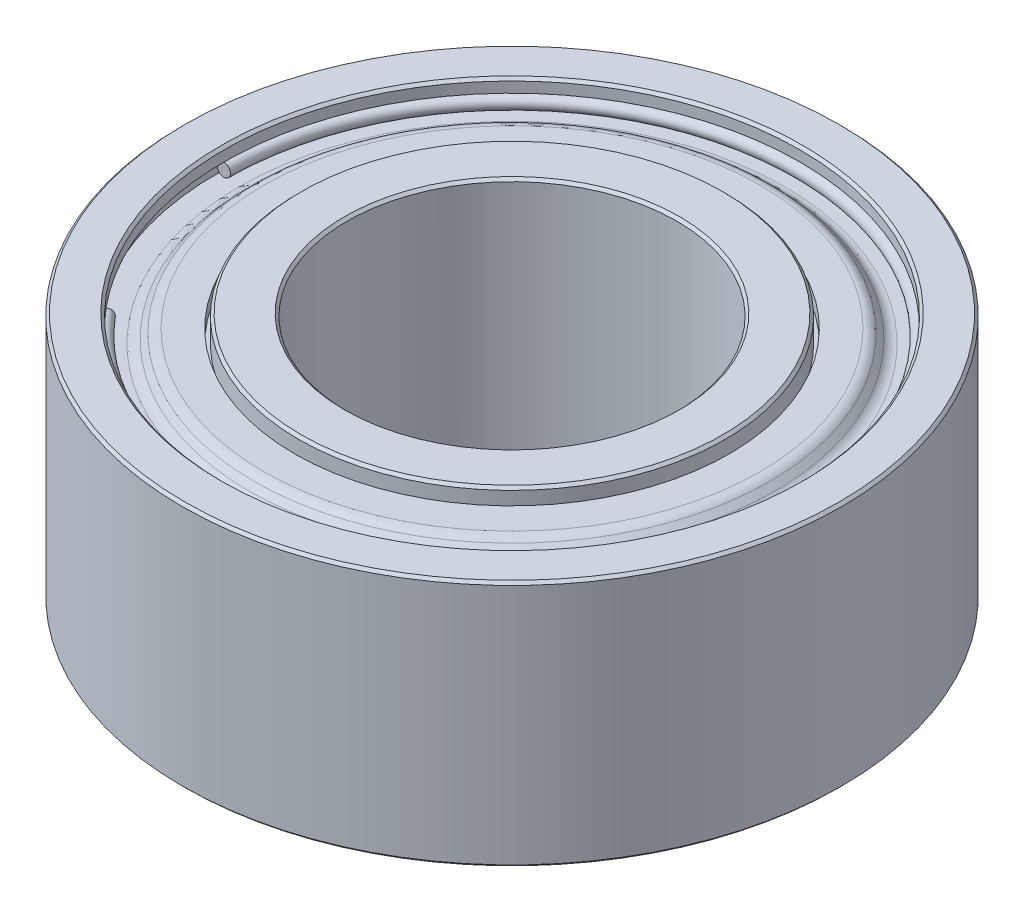
ISO-10303-21;
HEADER;
FILE_DESCRIPTION(('STEP AP214'),'2;1');
FILE_NAME('part.step','',(''),(''),'','','');
FILE_SCHEMA(('AUTOMOTIVE_DESIGN { 1 0 10303 214 1 1 1 1 }'));
ENDSEC;
DATA;
#1=APPLICATION_CONTEXT('core data for automotive mechanical design processes');
#2=APPLICATION_PROTOCOL_DEFINITION('international standard','automotive_design',2000,#1);
#3=PRODUCT_CONTEXT('',#1,'mechanical');
#4=PRODUCT('Part','Part','',(#3));
#5=PRODUCT_RELATED_PRODUCT_CATEGORY('part','',(#4));
#6=PRODUCT_DEFINITION_FORMATION('','',#4);
#7=PRODUCT_DEFINITION_CONTEXT('part definition',#1,'design');
#8=PRODUCT_DEFINITION('design','',#6,#7);
#9=PRODUCT_DEFINITION_SHAPE('','',#8);
#10=(LENGTH_UNIT() NAMED_UNIT(*) SI_UNIT(.MILLI.,.METRE.));
#11=(NAMED_UNIT(*) PLANE_ANGLE_UNIT() SI_UNIT($,.RADIAN.));
#12=(NAMED_UNIT(*) SI_UNIT($,.STERADIAN.) SOLID_ANGLE_UNIT());
#13=UNCERTAINTY_MEASURE_WITH_UNIT(LENGTH_MEASURE(1.E-05),#10,'distance_accuracy_value','');
#14=(GEOMETRIC_REPRESENTATION_CONTEXT(3) GLOBAL_UNCERTAINTY_ASSIGNED_CONTEXT((#13)) GLOBAL_UNIT_ASSIGNED_CONTEXT((#10,
#11,#12)) REPRESENTATION_CONTEXT('',''));
#15=CARTESIAN_POINT('',(0.,0.,0.));
#16=DIRECTION('',(0.,0.,1.));
#17=DIRECTION('',(1.,0.,0.));
#18=AXIS2_PLACEMENT_3D('',#15,#16,#17);
#19=CARTESIAN_POINT('',(0.,0.,0.));
#20=DIRECTION('',(0.64278760968653,0.,0.766044443118986));
#21=DIRECTION('',(0.766044443118986,0.,-0.64278760968653));
#22=AXIS2_PLACEMENT_3D('',#19,#20,#21);
#23=PLANE('',#22);
#24=CARTESIAN_POINT('',(-4.15418241058994,2.00025,3.48577292856909));
#25=CARTESIAN_POINT('',(-4.15418930493398,2.01448035707391,3.48577871361062));
#26=CARTESIAN_POINT('',(-4.15604733989819,2.02879828029162,3.48733779006381));
#27=CARTESIAN_POINT('',(-4.16328592517261,2.05577713981076,3.49341168429782));
#28=CARTESIAN_POINT('',(-4.16866647548281,2.06843807611218,3.49792650207864));
#29=CARTESIAN_POINT('',(-4.18233551241622,2.0907338982527,3.50939618592801));
#30=CARTESIAN_POINT('',(-4.1906239990395,2.10036878409172,3.51635105199662));
#31=CARTESIAN_POINT('',(-4.20917658235864,2.11551068307499,3.5319185178171));
#32=CARTESIAN_POINT('',(-4.2194406790545,2.12101769621925,3.54053111756897));
#33=CARTESIAN_POINT('',(-4.24078669527091,2.12728686264336,3.55844255190326));
#34=CARTESIAN_POINT('',(-4.25186861479146,2.12804901592321,3.56774138648568));
#35=CARTESIAN_POINT('',(-4.2736010893698,2.12474255040931,3.58597709788894));
#36=CARTESIAN_POINT('',(-4.2842516444276,2.12067393161555,3.59491397470978));
#37=CARTESIAN_POINT('',(-4.3039203487017,2.10816068190603,3.6114179772119));
#38=CARTESIAN_POINT('',(-4.31293849791799,2.09971605099026,3.61898510289319));
#39=CARTESIAN_POINT('',(-4.32832653587489,2.07941861413728,3.63189719986737));
#40=CARTESIAN_POINT('',(-4.33469642461549,2.06756580820007,3.63724217116025));
#41=CARTESIAN_POINT('',(-4.34406656395272,2.0417292051199,3.64510465162219));
#42=CARTESIAN_POINT('',(-4.34706681454934,2.02774540797693,3.64762216079126));
#43=CARTESIAN_POINT('',(-4.34858022980807,2.00916030553464,3.64889206697668));
#44=CARTESIAN_POINT('',(-4.34875985966417,2.00470945246293,3.64904279432268));
#45=CARTESIAN_POINT('',(-4.34875080479814,1.98601964292609,3.64903519638793));
#46=CARTESIAN_POINT('',(-4.34689276983392,1.97170171970838,3.64747611993475));
#47=CARTESIAN_POINT('',(-4.3396541845595,1.94472286018924,3.64140222570074));
#48=CARTESIAN_POINT('',(-4.3342736342493,1.93206192388782,3.63688740791991));
#49=CARTESIAN_POINT('',(-4.32060459731589,1.9097661017473,3.62541772407054));
#50=CARTESIAN_POINT('',(-4.31231611069261,1.90013121590828,3.61846285800193));
#51=CARTESIAN_POINT('',(-4.29376352737347,1.884989316925,3.60289539218146));
#52=CARTESIAN_POINT('',(-4.28349943067761,1.87948230378075,3.59428279242959));
#53=CARTESIAN_POINT('',(-4.2621534144612,1.87321313735664,3.5763713580953));
#54=CARTESIAN_POINT('',(-4.25107149494066,1.87245098407679,3.56707252351287));
#55=CARTESIAN_POINT('',(-4.22933902036231,1.87575744959069,3.54883681210961));
#56=CARTESIAN_POINT('',(-4.21868846530451,1.87982606838444,3.53989993528878));
#57=CARTESIAN_POINT('',(-4.19901976103042,1.89233931809397,3.52339593278665));
#58=CARTESIAN_POINT('',(-4.19000161181412,1.90078394900974,3.51582880710536));
#59=CARTESIAN_POINT('',(-4.17461357385723,1.92108138586272,3.50291671013119));
#60=CARTESIAN_POINT('',(-4.16824368511663,1.93293419179993,3.49757173883831));
#61=CARTESIAN_POINT('',(-4.1588735457794,1.9587707948801,3.48970925837636));
#62=CARTESIAN_POINT('',(-4.15587329518277,1.97275459202306,3.48719174920729));
#63=CARTESIAN_POINT('',(-4.15435987992404,1.99133969446536,3.48592184302187));
#64=CARTESIAN_POINT('',(-4.15418025006795,1.99579054753707,3.48577111567587));
#65=CARTESIAN_POINT('',(-4.15418241058994,2.00025,3.48577292856909));
#66=B_SPLINE_CURVE_WITH_KNOTS('',3,(#24,#25,#26,#27,#28,#29,#30,#31,#32,#33,#34,#35,#36,#37,#38,
#39,#40,#41,#42,#43,#44,#45,#46,#47,#48,#49,#50,#51,#52,#53,#54,#55,#56,#57,#58,#59,#60,#61,#62,
#63,#64,#65),.UNSPECIFIED.,.T.,.F.,(4,2,2,2,2,2,2,2,2,2,2,2,2,2,2,2,2,2,2,2,4),(0.,
0.0426429642402334,0.0852859284804667,0.127928892721777,0.170571856963085,0.213214821204394,
0.255857785445703,0.298500749687013,0.341143713928323,0.383786678169631,0.397149959984691,
0.439792924224925,0.482435888465158,0.525078852706467,0.567721816947776,0.610364781189085,
0.653007745430396,0.695650709671704,0.738293673913014,0.780936638154323,0.794299919969383),.UNSPECIFIED.);
#67=CARTESIAN_POINT('',(-4.15418241058994,2.00025,3.48577292856909));
#68=VERTEX_POINT('',#67);
#69=EDGE_CURVE('P0_E18',#68,#68,#66,.T.);
#70=ORIENTED_EDGE('',*,*,#69,.F.);
#71=EDGE_LOOP('',(#70));
#72=FACE_BOUND('',#71,.T.);
#73=ADVANCED_FACE('P0_F14',(#72),#23,.F.);
#74=CARTESIAN_POINT('',(0.,0.,0.));
#75=DIRECTION('',(0.,0.,1.));
#76=DIRECTION('',(1.,0.,0.));
#77=AXIS2_PLACEMENT_3D('',#74,#75,#76);
#78=PLANE('',#77);
#79=CARTESIAN_POINT('',(-5.6769,2.00025,0.));
#80=CARTESIAN_POINT('',(-5.67689100007304,2.01448035707391,0.));
#81=CARTESIAN_POINT('',(-5.67446550768693,2.02879828029162,0.));
#82=CARTESIAN_POINT('',(-5.66501620570525,2.05577713981076,0.));
#83=CARTESIAN_POINT('',(-5.65799239610969,2.06843807611218,0.));
#84=CARTESIAN_POINT('',(-5.64014873565866,2.0907338982527,0.));
#85=CARTESIAN_POINT('',(-5.62932888480311,2.10036878409172,0.));
#86=CARTESIAN_POINT('',(-5.60511020730236,2.11551068307499,0.));
#87=CARTESIAN_POINT('',(-5.59171138065716,2.12101769621925,0.));
#88=CARTESIAN_POINT('',(-5.56384613549006,2.12728686264336,0.));
#89=CARTESIAN_POINT('',(-5.54937971696815,2.12804901592321,0.));
#90=CARTESIAN_POINT('',(-5.52100998623835,2.12474255040931,0.));
#91=CARTESIAN_POINT('',(-5.50710667403046,2.12067393161555,0.));
#92=CARTESIAN_POINT('',(-5.48143100409933,2.10816068190603,0.));
#93=CARTESIAN_POINT('',(-5.4696586463761,2.09971605099026,0.));
#94=CARTESIAN_POINT('',(-5.44957098945865,2.07941861413728,0.));
#95=CARTESIAN_POINT('',(-5.44125569026443,2.06756580820007,0.));
#96=CARTESIAN_POINT('',(-5.42902384207155,2.0417292051199,0.));
#97=CARTESIAN_POINT('',(-5.4251072930729,2.02774540797694,0.));
#98=CARTESIAN_POINT('',(-5.42313166976236,2.00916030553464,0.));
#99=CARTESIAN_POINT('',(-5.42289717963883,2.00470945246293,0.));
#100=CARTESIAN_POINT('',(-5.42290899992696,1.98601964292609,0.));
#101=CARTESIAN_POINT('',(-5.42533449231307,1.97170171970838,0.));
#102=CARTESIAN_POINT('',(-5.43478379429475,1.94472286018924,0.));
#103=CARTESIAN_POINT('',(-5.44180760389031,1.93206192388782,0.));
#104=CARTESIAN_POINT('',(-5.45965126434134,1.9097661017473,0.));
#105=CARTESIAN_POINT('',(-5.47047111519689,1.90013121590828,0.));
#106=CARTESIAN_POINT('',(-5.49468979269764,1.884989316925,0.));
#107=CARTESIAN_POINT('',(-5.50808861934284,1.87948230378075,0.));
#108=CARTESIAN_POINT('',(-5.53595386450994,1.87321313735664,0.));
#109=CARTESIAN_POINT('',(-5.55042028303185,1.87245098407679,0.));
#110=CARTESIAN_POINT('',(-5.57879001376165,1.87575744959069,0.));
#111=CARTESIAN_POINT('',(-5.59269332596954,1.87982606838444,0.));
#112=CARTESIAN_POINT('',(-5.61836899590066,1.89233931809397,0.));
#113=CARTESIAN_POINT('',(-5.6301413536239,1.90078394900974,0.));
#114=CARTESIAN_POINT('',(-5.65022901054135,1.92108138586272,0.));
#115=CARTESIAN_POINT('',(-5.65854430973557,1.93293419179993,0.));
#116=CARTESIAN_POINT('',(-5.67077615792845,1.9587707948801,0.));
#117=CARTESIAN_POINT('',(-5.6746927069271,1.97275459202306,0.));
#118=CARTESIAN_POINT('',(-5.67666833023764,1.99133969446536,0.));
#119=CARTESIAN_POINT('',(-5.67690282036117,1.99579054753707,0.));
#120=CARTESIAN_POINT('',(-5.6769,2.00025,0.));
#121=B_SPLINE_CURVE_WITH_KNOTS('',3,(#79,#80,#81,#82,#83,#84,#85,#86,#87,#88,#89,#90,#91,#92,
#93,#94,#95,#96,#97,#98,#99,#100,#101,#102,#103,#104,#105,#106,#107,#108,#109,#110,#111,#112,
#113,#114,#115,#116,#117,#118,#119,#120),.UNSPECIFIED.,.T.,.F.,(4,2,2,2,2,2,2,2,2,2,2,2,2,2,2,2,
2,2,2,2,4),(0.,0.0426429642402329,0.0852859284804661,0.127928892721774,0.170571856963085,
0.213214821204393,0.255857785445703,0.298500749687013,0.341143713928322,0.383786678169631,
0.397149959984692,0.439792924224925,0.482435888465158,0.525078852706467,0.567721816947776,
0.610364781189086,0.653007745430395,0.695650709671704,0.738293673913013,0.780936638154323,
0.794299919969383),.UNSPECIFIED.);
#122=CARTESIAN_POINT('',(-5.6769,2.00025,0.));
#123=VERTEX_POINT('',#122);
#124=EDGE_CURVE('P0_E9',#123,#123,#121,.T.);
#125=ORIENTED_EDGE('',*,*,#124,.F.);
#126=EDGE_LOOP('',(#125));
#127=FACE_BOUND('',#126,.T.);
#128=ADVANCED_FACE('P0_F36',(#127),#78,.T.);
#129=CARTESIAN_POINT('',(0.,2.00025,0.));
#130=DIRECTION('',(0.,1.,0.));
#131=DIRECTION('',(0.,0.,1.));
#132=AXIS2_PLACEMENT_3D('',#129,#130,#131);
#133=TOROIDAL_SURFACE('',#132,5.5499,0.127000000000001);
#134=ORIENTED_EDGE('',*,*,#124,.T.);
#135=EDGE_LOOP('',(#134));
#136=FACE_BOUND('',#135,.T.);
#137=ORIENTED_EDGE('',*,*,#69,.T.);
#138=EDGE_LOOP('',(#137));
#139=FACE_BOUND('',#138,.T.);
#140=ADVANCED_FACE('P0_F34',(#136,#139),#133,.T.);
#141=CLOSED_SHELL('',(#73,#128,#140));
#142=MANIFOLD_SOLID_BREP('P0_B1',#141);
#143=CARTESIAN_POINT('',(0.,0.,0.));
#144=DIRECTION('',(0.,0.,1.));
#145=DIRECTION('',(1.,0.,0.));
#146=AXIS2_PLACEMENT_3D('',#143,#144,#145);
#147=PLANE('',#146);
#148=CARTESIAN_POINT('',(-5.4229,-2.00025,0.));
#149=CARTESIAN_POINT('',(-5.42290899992696,-2.01448035707391,0.));
#150=CARTESIAN_POINT('',(-5.42533449231307,-2.02879828029162,0.));
#151=CARTESIAN_POINT('',(-5.43478379429475,-2.05577713981076,0.));
#152=CARTESIAN_POINT('',(-5.44180760389031,-2.06843807611218,0.));
#153=CARTESIAN_POINT('',(-5.45965126434134,-2.0907338982527,0.));
#154=CARTESIAN_POINT('',(-5.47047111519689,-2.10036878409172,0.));
#155=CARTESIAN_POINT('',(-5.49468979269764,-2.11551068307499,0.));
#156=CARTESIAN_POINT('',(-5.50808861934284,-2.12101769621925,0.));
#157=CARTESIAN_POINT('',(-5.53595386450994,-2.12728686264336,0.));
#158=CARTESIAN_POINT('',(-5.55042028303185,-2.12804901592321,0.));
#159=CARTESIAN_POINT('',(-5.57879001376165,-2.12474255040931,0.));
#160=CARTESIAN_POINT('',(-5.59269332596954,-2.12067393161555,0.));
#161=CARTESIAN_POINT('',(-5.61836899590066,-2.10816068190603,0.));
#162=CARTESIAN_POINT('',(-5.6301413536239,-2.09971605099026,0.));
#163=CARTESIAN_POINT('',(-5.65022901054135,-2.07941861413728,0.));
#164=CARTESIAN_POINT('',(-5.65854430973557,-2.06756580820007,0.));
#165=CARTESIAN_POINT('',(-5.67077615792845,-2.0417292051199,0.));
#166=CARTESIAN_POINT('',(-5.6746927069271,-2.02774540797694,0.));
#167=CARTESIAN_POINT('',(-5.67666833023764,-2.00916030553464,0.));
#168=CARTESIAN_POINT('',(-5.67690282036117,-2.00470945246293,0.));
#169=CARTESIAN_POINT('',(-5.67689100007304,-1.98601964292609,0.));
#170=CARTESIAN_POINT('',(-5.67446550768693,-1.97170171970838,0.));
#171=CARTESIAN_POINT('',(-5.66501620570525,-1.94472286018924,0.));
#172=CARTESIAN_POINT('',(-5.65799239610969,-1.93206192388782,0.));
#173=CARTESIAN_POINT('',(-5.64014873565866,-1.9097661017473,0.));
#174=CARTESIAN_POINT('',(-5.62932888480311,-1.90013121590828,0.));
#175=CARTESIAN_POINT('',(-5.60511020730236,-1.884989316925,0.));
#176=CARTESIAN_POINT('',(-5.59171138065716,-1.87948230378075,0.));
#177=CARTESIAN_POINT('',(-5.56384613549006,-1.87321313735664,0.));
#178=CARTESIAN_POINT('',(-5.54937971696815,-1.87245098407679,0.));
#179=CARTESIAN_POINT('',(-5.52100998623835,-1.87575744959069,0.));
#180=CARTESIAN_POINT('',(-5.50710667403046,-1.87982606838444,0.));
#181=CARTESIAN_POINT('',(-5.48143100409934,-1.89233931809397,0.));
#182=CARTESIAN_POINT('',(-5.4696586463761,-1.90078394900974,0.));
#183=CARTESIAN_POINT('',(-5.44957098945865,-1.92108138586272,0.));
#184=CARTESIAN_POINT('',(-5.44125569026443,-1.93293419179993,0.));
#185=CARTESIAN_POINT('',(-5.42902384207155,-1.9587707948801,0.));
#186=CARTESIAN_POINT('',(-5.4251072930729,-1.97275459202306,0.));
#187=CARTESIAN_POINT('',(-5.42313166976236,-1.99133969446536,0.));
#188=CARTESIAN_POINT('',(-5.42289717963883,-1.99579054753707,0.));
#189=CARTESIAN_POINT('',(-5.4229,-2.00025,0.));
#190=B_SPLINE_CURVE_WITH_KNOTS('',3,(#148,#149,#150,#151,#152,#153,#154,#155,#156,#157,#158,
#159,#160,#161,#162,#163,#164,#165,#166,#167,#168,#169,#170,#171,#172,#173,#174,#175,#176,#177,
#178,#179,#180,#181,#182,#183,#184,#185,#186,#187,#188,#189),.UNSPECIFIED.,.T.,.F.,(4,2,2,2,2,2,
2,2,2,2,2,2,2,2,2,2,2,2,2,2,4),(0.,0.0426429642402333,0.0852859284804666,0.127928892721776,
0.170571856963085,0.213214821204395,0.255857785445704,0.298500749687012,0.341143713928322,
0.383786678169631,0.397149959984692,0.439792924224925,0.482435888465158,0.525078852706467,
0.567721816947776,0.610364781189086,0.653007745430394,0.695650709671705,0.738293673913014,
0.780936638154323,0.794299919969383),.UNSPECIFIED.);
#191=CARTESIAN_POINT('',(-5.4229,-2.00025,0.));
#192=VERTEX_POINT('',#191);
#193=EDGE_CURVE('P1_E19',#192,#192,#190,.T.);
#194=ORIENTED_EDGE('',*,*,#193,.F.);
#195=EDGE_LOOP('',(#194));
#196=FACE_BOUND('',#195,.T.);
#197=ADVANCED_FACE('P1_F15',(#196),#147,.T.);
#198=CARTESIAN_POINT('',(0.,0.,0.));
#199=DIRECTION('',(0.64278760968653,0.,0.766044443118986));
#200=DIRECTION('',(0.766044443118986,0.,-0.64278760968653));
#201=AXIS2_PLACEMENT_3D('',#198,#199,#200);
#202=PLANE('',#201);
#203=CARTESIAN_POINT('',(-4.34875769914217,-2.00025,3.64904098142946));
#204=CARTESIAN_POINT('',(-4.34875080479814,-2.01448035707391,3.64903519638793));
#205=CARTESIAN_POINT('',(-4.34689276983393,-2.02879828029162,3.64747611993474));
#206=CARTESIAN_POINT('',(-4.33965418455951,-2.05577713981076,3.64140222570073));
#207=CARTESIAN_POINT('',(-4.3342736342493,-2.06843807611218,3.63688740791991));
#208=CARTESIAN_POINT('',(-4.32060459731589,-2.0907338982527,3.62541772407054));
#209=CARTESIAN_POINT('',(-4.31231611069262,-2.10036878409172,3.61846285800193));
#210=CARTESIAN_POINT('',(-4.29376352737348,-2.11551068307499,3.60289539218145));
#211=CARTESIAN_POINT('',(-4.28349943067761,-2.12101769621925,3.59428279242959));
#212=CARTESIAN_POINT('',(-4.2621534144612,-2.12728686264336,3.57637135809529));
#213=CARTESIAN_POINT('',(-4.25107149494066,-2.12804901592321,3.56707252351287));
#214=CARTESIAN_POINT('',(-4.22933902036231,-2.12474255040931,3.54883681210961));
#215=CARTESIAN_POINT('',(-4.21868846530451,-2.12067393161555,3.53989993528878));
#216=CARTESIAN_POINT('',(-4.19901976103042,-2.10816068190603,3.52339593278665));
#217=CARTESIAN_POINT('',(-4.19000161181413,-2.09971605099026,3.51582880710536));
#218=CARTESIAN_POINT('',(-4.17461357385723,-2.07941861413728,3.50291671013118));
#219=CARTESIAN_POINT('',(-4.16824368511663,-2.06756580820007,3.4975717388383));
#220=CARTESIAN_POINT('',(-4.1588735457794,-2.0417292051199,3.48970925837636));
#221=CARTESIAN_POINT('',(-4.15587329518277,-2.02774540797694,3.48719174920729));
#222=CARTESIAN_POINT('',(-4.15435987992404,-2.00916030553464,3.48592184302187));
#223=CARTESIAN_POINT('',(-4.15418025006795,-2.00470945246293,3.48577111567587));
#224=CARTESIAN_POINT('',(-4.15418930493398,-1.98601964292609,3.48577871361062));
#225=CARTESIAN_POINT('',(-4.15604733989819,-1.97170171970838,3.4873377900638));
#226=CARTESIAN_POINT('',(-4.16328592517261,-1.94472286018924,3.49341168429781));
#227=CARTESIAN_POINT('',(-4.16866647548282,-1.93206192388782,3.49792650207864));
#228=CARTESIAN_POINT('',(-4.18233551241623,-1.9097661017473,3.50939618592801));
#229=CARTESIAN_POINT('',(-4.1906239990395,-1.90013121590828,3.51635105199662));
#230=CARTESIAN_POINT('',(-4.20917658235864,-1.884989316925,3.5319185178171));
#231=CARTESIAN_POINT('',(-4.2194406790545,-1.87948230378075,3.54053111756896));
#232=CARTESIAN_POINT('',(-4.24078669527091,-1.87321313735664,3.55844255190326));
#233=CARTESIAN_POINT('',(-4.25186861479146,-1.87245098407679,3.56774138648568));
#234=CARTESIAN_POINT('',(-4.2736010893698,-1.87575744959069,3.58597709788894));
#235=CARTESIAN_POINT('',(-4.28425164442761,-1.87982606838444,3.59491397470977));
#236=CARTESIAN_POINT('',(-4.3039203487017,-1.89233931809397,3.6114179772119));
#237=CARTESIAN_POINT('',(-4.31293849791799,-1.90078394900974,3.61898510289319));
#238=CARTESIAN_POINT('',(-4.32832653587489,-1.92108138586272,3.63189719986736));
#239=CARTESIAN_POINT('',(-4.33469642461549,-1.93293419179993,3.63724217116024));
#240=CARTESIAN_POINT('',(-4.34406656395272,-1.9587707948801,3.64510465162219));
#241=CARTESIAN_POINT('',(-4.34706681454934,-1.97275459202306,3.64762216079126));
#242=CARTESIAN_POINT('',(-4.34858022980807,-1.99133969446536,3.64889206697668));
#243=CARTESIAN_POINT('',(-4.34875985966417,-1.99579054753707,3.64904279432267));
#244=CARTESIAN_POINT('',(-4.34875769914217,-2.00025,3.64904098142946));
#245=B_SPLINE_CURVE_WITH_KNOTS('',3,(#203,#204,#205,#206,#207,#208,#209,#210,#211,#212,#213,
#214,#215,#216,#217,#218,#219,#220,#221,#222,#223,#224,#225,#226,#227,#228,#229,#230,#231,#232,
#233,#234,#235,#236,#237,#238,#239,#240,#241,#242,#243,#244),.UNSPECIFIED.,.T.,.F.,(4,2,2,2,2,2,
2,2,2,2,2,2,2,2,2,2,2,2,2,2,4),(0.,0.0426429642402328,0.0852859284804664,0.127928892721775,
0.170571856963085,0.213214821204396,0.255857785445703,0.298500749687012,0.341143713928322,
0.383786678169631,0.397149959984692,0.439792924224925,0.482435888465158,0.525078852706467,
0.567721816947776,0.610364781189086,0.653007745430396,0.695650709671705,0.738293673913013,
0.780936638154323,0.794299919969383),.UNSPECIFIED.);
#246=CARTESIAN_POINT('',(-4.34875769914217,-2.00025,3.64904098142946));
#247=VERTEX_POINT('',#246);
#248=EDGE_CURVE('P1_E10',#247,#247,#245,.T.);
#249=ORIENTED_EDGE('',*,*,#248,.F.);
#250=EDGE_LOOP('',(#249));
#251=FACE_BOUND('',#250,.T.);
#252=ADVANCED_FACE('P1_F35',(#251),#202,.F.);
#253=CARTESIAN_POINT('',(0.,-2.00025,0.));
#254=DIRECTION('',(0.,-1.,0.));
#255=DIRECTION('',(0.,0.,1.));
#256=AXIS2_PLACEMENT_3D('',#253,#254,#255);
#257=TOROIDAL_SURFACE('',#256,5.5499,0.127000000000001);
#258=ORIENTED_EDGE('',*,*,#248,.T.);
#259=EDGE_LOOP('',(#258));
#260=FACE_BOUND('',#259,.T.);
#261=ORIENTED_EDGE('',*,*,#193,.T.);
#262=EDGE_LOOP('',(#261));
#263=FACE_BOUND('',#262,.T.);
#264=ADVANCED_FACE('P1_F37',(#260,#263),#257,.T.);
#265=CLOSED_SHELL('',(#197,#252,#264));
#266=MANIFOLD_SOLID_BREP('P1_B1',#265);
#267=CARTESIAN_POINT('',(0.,2.38125,0.));
#268=DIRECTION('',(0.,-1.,0.));
#269=DIRECTION('',(0.,0.,-1.));
#270=AXIS2_PLACEMENT_3D('',#267,#268,#269);
#271=CYLINDRICAL_SURFACE('',#270,3.175);
#272=CARTESIAN_POINT('',(0.,-2.33045000004495,0.));
#273=DIRECTION('',(0.,-1.,0.));
#274=DIRECTION('',(0.,0.,-1.));
#275=AXIS2_PLACEMENT_3D('',#272,#273,#274);
#276=CIRCLE('',#275,3.17499999999882);
#277=CARTESIAN_POINT('',(0.,-2.33045000004495,-3.17499999999882));
#278=VERTEX_POINT('',#277);
#279=EDGE_CURVE('P2_E410',#278,#278,#276,.T.);
#280=ORIENTED_EDGE('',*,*,#279,.T.);
#281=EDGE_LOOP('',(#280));
#282=FACE_BOUND('',#281,.T.);
#283=CARTESIAN_POINT('',(0.,2.3304499999881,0.));
#284=DIRECTION('',(0.,1.,0.));
#285=DIRECTION('',(0.,0.,1.));
#286=AXIS2_PLACEMENT_3D('',#283,#284,#285);
#287=CIRCLE('',#286,3.17500000005566);
#288=CARTESIAN_POINT('',(0.,2.3304499999881,3.17500000005566));
#289=VERTEX_POINT('',#288);
#290=EDGE_CURVE('P2_E413',#289,#289,#287,.T.);
#291=ORIENTED_EDGE('',*,*,#290,.T.);
#292=EDGE_LOOP('',(#291));
#293=FACE_BOUND('',#292,.T.);
#294=ADVANCED_FACE('P2_F17',(#282,#293),#271,.F.);
#295=CARTESIAN_POINT('',(0.,2.38124999992806,0.));
#296=DIRECTION('',(0.,1.,0.));
#297=DIRECTION('',(0.,0.,1.));
#298=AXIS2_PLACEMENT_3D('',#295,#296,#297);
#299=CONICAL_SURFACE('',#298,3.22579999999562,0.785398163397448);
#300=ORIENTED_EDGE('',*,*,#290,.F.);
#301=EDGE_LOOP('',(#300));
#302=FACE_BOUND('',#301,.T.);
#303=CARTESIAN_POINT('',(0.,2.38124999992806,0.));
#304=DIRECTION('',(0.,1.,0.));
#305=DIRECTION('',(0.,0.,1.));
#306=AXIS2_PLACEMENT_3D('',#303,#304,#305);
#307=CIRCLE('',#306,3.22579999999562);
#308=CARTESIAN_POINT('',(0.,2.38124999992806,3.22579999999562));
#309=VERTEX_POINT('',#308);
#310=EDGE_CURVE('P2_E408',#309,#309,#307,.F.);
#311=ORIENTED_EDGE('',*,*,#310,.F.);
#312=EDGE_LOOP('',(#311));
#313=FACE_BOUND('',#312,.T.);
#314=ADVANCED_FACE('P2_F186',(#302,#313),#299,.F.);
#315=CARTESIAN_POINT('',(0.,-2.3812499999849,0.));
#316=DIRECTION('',(0.,-1.,0.));
#317=DIRECTION('',(0.,0.,-1.));
#318=AXIS2_PLACEMENT_3D('',#315,#316,#317);
#319=CONICAL_SURFACE('',#318,3.22579999993877,0.785398162837966);
#320=CARTESIAN_POINT('',(0.,-2.3812499999849,0.));
#321=DIRECTION('',(0.,-1.,0.));
#322=DIRECTION('',(0.,0.,-1.));
#323=AXIS2_PLACEMENT_3D('',#320,#321,#322);
#324=CIRCLE('',#323,3.22579999993877);
#325=CARTESIAN_POINT('',(0.,-2.3812499999849,-3.22579999993877));
#326=VERTEX_POINT('',#325);
#327=EDGE_CURVE('P2_E406',#326,#326,#324,.T.);
#328=ORIENTED_EDGE('',*,*,#327,.T.);
#329=EDGE_LOOP('',(#328));
#330=FACE_BOUND('',#329,.T.);
#331=ORIENTED_EDGE('',*,*,#279,.F.);
#332=EDGE_LOOP('',(#331));
#333=FACE_BOUND('',#332,.T.);
#334=ADVANCED_FACE('P2_F183',(#330,#333),#319,.F.);
#335=CARTESIAN_POINT('',(0.,2.38125,0.));
#336=DIRECTION('',(0.,1.,0.));
#337=DIRECTION('',(0.,0.,1.));
#338=AXIS2_PLACEMENT_3D('',#335,#336,#337);
#339=PLANE('',#338);
#340=ORIENTED_EDGE('',*,*,#310,.T.);
#341=EDGE_LOOP('',(#340));
#342=FACE_BOUND('',#341,.T.);
#343=CARTESIAN_POINT('',(0.,2.3812499999849,0.));
#344=DIRECTION('',(0.,-1.,0.));
#345=DIRECTION('',(0.,0.,-1.));
#346=AXIS2_PLACEMENT_3D('',#343,#344,#345);
#347=CIRCLE('',#346,4.05764999999292);
#348=CARTESIAN_POINT('',(0.,2.3812499999849,-4.05764999999292));
#349=VERTEX_POINT('',#348);
#350=EDGE_CURVE('P2_E403',#349,#349,#347,.T.);
#351=ORIENTED_EDGE('',*,*,#350,.F.);
#352=EDGE_LOOP('',(#351));
#353=FACE_BOUND('',#352,.T.);
#354=ADVANCED_FACE('P2_F179',(#342,#353),#339,.T.);
#355=CARTESIAN_POINT('',(0.,-2.38125,0.));
#356=DIRECTION('',(0.,1.,0.));
#357=DIRECTION('',(0.,0.,1.));
#358=AXIS2_PLACEMENT_3D('',#355,#356,#357);
#359=PLANE('',#358);
#360=CARTESIAN_POINT('',(0.,-2.38125000004175,0.));
#361=DIRECTION('',(0.,1.,0.));
#362=DIRECTION('',(0.,0.,1.));
#363=AXIS2_PLACEMENT_3D('',#360,#361,#362);
#364=CIRCLE('',#363,4.05764999993607);
#365=CARTESIAN_POINT('',(0.,-2.38125000004175,4.05764999993607));
#366=VERTEX_POINT('',#365);
#367=EDGE_CURVE('P2_E399',#366,#366,#364,.T.);
#368=ORIENTED_EDGE('',*,*,#367,.F.);
#369=EDGE_LOOP('',(#368));
#370=FACE_BOUND('',#369,.T.);
#371=ORIENTED_EDGE('',*,*,#327,.F.);
#372=EDGE_LOOP('',(#371));
#373=FACE_BOUND('',#372,.T.);
#374=ADVANCED_FACE('P2_F175',(#370,#373),#359,.F.);
#375=CARTESIAN_POINT('',(0.,2.33044999987442,0.));
#376=DIRECTION('',(0.,-1.,0.));
#377=DIRECTION('',(0.,0.,-1.));
#378=AXIS2_PLACEMENT_3D('',#375,#376,#377);
#379=CONICAL_SURFACE('',#378,4.1084500001034,0.785398163397448);
#380=ORIENTED_EDGE('',*,*,#350,.T.);
#381=EDGE_LOOP('',(#380));
#382=FACE_BOUND('',#381,.T.);
#383=CARTESIAN_POINT('',(0.,2.33045,0.));
#384=DIRECTION('',(0.,1.,0.));
#385=DIRECTION('',(0.,0.,1.));
#386=AXIS2_PLACEMENT_3D('',#383,#384,#385);
#387=CIRCLE('',#386,4.10845);
#388=CARTESIAN_POINT('',(0.,2.33045,4.10845));
#389=VERTEX_POINT('',#388);
#390=EDGE_CURVE('P2_E402',#389,#389,#387,.F.);
#391=ORIENTED_EDGE('',*,*,#390,.F.);
#392=EDGE_LOOP('',(#391));
#393=FACE_BOUND('',#392,.T.);
#394=ADVANCED_FACE('P2_F171',(#382,#393),#379,.T.);
#395=CARTESIAN_POINT('',(0.,-2.3304499999881,0.));
#396=DIRECTION('',(0.,1.,0.));
#397=DIRECTION('',(0.,0.,1.));
#398=AXIS2_PLACEMENT_3D('',#395,#396,#397);
#399=CONICAL_SURFACE('',#398,4.10844999998972,0.785398163397448);
#400=CARTESIAN_POINT('',(0.,-2.33045,0.));
#401=DIRECTION('',(0.,-1.,0.));
#402=DIRECTION('',(0.,0.,-1.));
#403=AXIS2_PLACEMENT_3D('',#400,#401,#402);
#404=CIRCLE('',#403,4.10845);
#405=CARTESIAN_POINT('',(0.,-2.33045,-4.10845));
#406=VERTEX_POINT('',#405);
#407=EDGE_CURVE('P2_E79',#406,#406,#404,.F.);
#408=ORIENTED_EDGE('',*,*,#407,.F.);
#409=EDGE_LOOP('',(#408));
#410=FACE_BOUND('',#409,.T.);
#411=ORIENTED_EDGE('',*,*,#367,.T.);
#412=EDGE_LOOP('',(#411));
#413=FACE_BOUND('',#412,.T.);
#414=ADVANCED_FACE('P2_F167',(#410,#413),#399,.T.);
#415=CARTESIAN_POINT('',(0.,2.12725,0.));
#416=DIRECTION('',(0.,1.,0.));
#417=DIRECTION('',(0.,0.,1.));
#418=AXIS2_PLACEMENT_3D('',#415,#416,#417);
#419=CYLINDRICAL_SURFACE('',#418,4.10845);
#420=CARTESIAN_POINT('',(0.,1.87325,0.));
#421=DIRECTION('',(0.,1.,0.));
#422=DIRECTION('',(0.,0.,1.));
#423=AXIS2_PLACEMENT_3D('',#420,#421,#422);
#424=CIRCLE('',#423,4.10845);
#425=CARTESIAN_POINT('',(0.,1.87325,4.10845));
#426=VERTEX_POINT('',#425);
#427=EDGE_CURVE('P2_E396',#426,#426,#424,.F.);
#428=ORIENTED_EDGE('',*,*,#427,.F.);
#429=EDGE_LOOP('',(#428));
#430=FACE_BOUND('',#429,.T.);
#431=ORIENTED_EDGE('',*,*,#390,.T.);
#432=EDGE_LOOP('',(#431));
#433=FACE_BOUND('',#432,.T.);
#434=ADVANCED_FACE('P2_F163',(#430,#433),#419,.T.);
#435=CARTESIAN_POINT('',(0.,-2.12725,0.));
#436=DIRECTION('',(0.,-1.,0.));
#437=DIRECTION('',(0.,0.,-1.));
#438=AXIS2_PLACEMENT_3D('',#435,#436,#437);
#439=CYLINDRICAL_SURFACE('',#438,4.10845);
#440=ORIENTED_EDGE('',*,*,#407,.T.);
#441=EDGE_LOOP('',(#440));
#442=FACE_BOUND('',#441,.T.);
#443=CARTESIAN_POINT('',(0.,-1.87325,0.));
#444=DIRECTION('',(0.,-1.,0.));
#445=DIRECTION('',(0.,0.,-1.));
#446=AXIS2_PLACEMENT_3D('',#443,#444,#445);
#447=CIRCLE('',#446,4.10845);
#448=CARTESIAN_POINT('',(0.,-1.87325,-4.10845));
#449=VERTEX_POINT('',#448);
#450=EDGE_CURVE('P2_E393',#449,#449,#447,.F.);
#451=ORIENTED_EDGE('',*,*,#450,.F.);
#452=EDGE_LOOP('',(#451));
#453=FACE_BOUND('',#452,.T.);
#454=ADVANCED_FACE('P2_F159',(#442,#453),#439,.T.);
#455=CARTESIAN_POINT('',(0.,1.87325,0.));
#456=DIRECTION('',(0.,1.,0.));
#457=DIRECTION('',(0.,0.,1.));
#458=AXIS2_PLACEMENT_3D('',#455,#456,#457);
#459=PLANE('',#458);
#460=CARTESIAN_POINT('',(0.,1.87325,0.));
#461=DIRECTION('',(0.,1.,0.));
#462=DIRECTION('',(0.,0.,1.));
#463=AXIS2_PLACEMENT_3D('',#460,#461,#462);
#464=CIRCLE('',#463,4.1855922886146);
#465=CARTESIAN_POINT('',(0.,1.87325,4.1855922886146));
#466=VERTEX_POINT('',#465);
#467=EDGE_CURVE('P2_E390',#466,#466,#464,.T.);
#468=ORIENTED_EDGE('',*,*,#467,.T.);
#469=EDGE_LOOP('',(#468));
#470=FACE_BOUND('',#469,.T.);
#471=ORIENTED_EDGE('',*,*,#427,.T.);
#472=EDGE_LOOP('',(#471));
#473=FACE_BOUND('',#472,.T.);
#474=ADVANCED_FACE('P2_F155',(#470,#473),#459,.T.);
#475=CARTESIAN_POINT('',(0.,-1.87325,0.));
#476=DIRECTION('',(0.,-1.,0.));
#477=DIRECTION('',(0.,0.,-1.));
#478=AXIS2_PLACEMENT_3D('',#475,#476,#477);
#479=PLANE('',#478);
#480=ORIENTED_EDGE('',*,*,#450,.T.);
#481=EDGE_LOOP('',(#480));
#482=FACE_BOUND('',#481,.T.);
#483=CARTESIAN_POINT('',(0.,-1.87325,0.));
#484=DIRECTION('',(0.,-1.,0.));
#485=DIRECTION('',(0.,0.,-1.));
#486=AXIS2_PLACEMENT_3D('',#483,#484,#485);
#487=CIRCLE('',#486,4.1855922886146);
#488=CARTESIAN_POINT('',(0.,-1.87325,-4.1855922886146));
#489=VERTEX_POINT('',#488);
#490=EDGE_CURVE('P2_E387',#489,#489,#487,.T.);
#491=ORIENTED_EDGE('',*,*,#490,.T.);
#492=EDGE_LOOP('',(#491));
#493=FACE_BOUND('',#492,.T.);
#494=ADVANCED_FACE('P2_F151',(#482,#493),#479,.T.);
#495=CARTESIAN_POINT('',(0.,1.87325,0.));
#496=DIRECTION('',(0.,1.,0.));
#497=DIRECTION('',(0.,0.,1.));
#498=AXIS2_PLACEMENT_3D('',#495,#496,#497);
#499=CYLINDRICAL_SURFACE('',#498,4.1855922886146);
#500=CARTESIAN_POINT('',(0.,2.12725,0.));
#501=DIRECTION('',(0.,1.,0.));
#502=DIRECTION('',(0.,0.,1.));
#503=AXIS2_PLACEMENT_3D('',#500,#501,#502);
#504=CIRCLE('',#503,4.1855922886146);
#505=CARTESIAN_POINT('',(0.,2.12725,4.1855922886146));
#506=VERTEX_POINT('',#505);
#507=EDGE_CURVE('P2_E384',#506,#506,#504,.F.);
#508=ORIENTED_EDGE('',*,*,#507,.F.);
#509=EDGE_LOOP('',(#508));
#510=FACE_BOUND('',#509,.T.);
#511=ORIENTED_EDGE('',*,*,#467,.F.);
#512=EDGE_LOOP('',(#511));
#513=FACE_BOUND('',#512,.T.);
#514=ADVANCED_FACE('P2_F147',(#510,#513),#499,.F.);
#515=CARTESIAN_POINT('',(0.,-1.87325,0.));
#516=DIRECTION('',(0.,-1.,0.));
#517=DIRECTION('',(0.,0.,-1.));
#518=AXIS2_PLACEMENT_3D('',#515,#516,#517);
#519=CYLINDRICAL_SURFACE('',#518,4.1855922886146);
#520=ORIENTED_EDGE('',*,*,#490,.F.);
#521=EDGE_LOOP('',(#520));
#522=FACE_BOUND('',#521,.T.);
#523=CARTESIAN_POINT('',(0.,-2.12725,0.));
#524=DIRECTION('',(0.,-1.,0.));
#525=DIRECTION('',(0.,0.,-1.));
#526=AXIS2_PLACEMENT_3D('',#523,#524,#525);
#527=CIRCLE('',#526,4.1855922886146);
#528=CARTESIAN_POINT('',(0.,-2.12725,-4.1855922886146));
#529=VERTEX_POINT('',#528);
#530=EDGE_CURVE('P2_E65',#529,#529,#527,.F.);
#531=ORIENTED_EDGE('',*,*,#530,.F.);
#532=EDGE_LOOP('',(#531));
#533=FACE_BOUND('',#532,.T.);
#534=ADVANCED_FACE('P2_F143',(#522,#533),#519,.F.);
#535=CARTESIAN_POINT('',(0.,2.12725,0.));
#536=DIRECTION('',(0.,1.,0.));
#537=DIRECTION('',(0.,0.,1.));
#538=AXIS2_PLACEMENT_3D('',#535,#536,#537);
#539=PLANE('',#538);
#540=CARTESIAN_POINT('',(0.,2.12725,0.));
#541=DIRECTION('',(0.,-1.,0.));
#542=DIRECTION('',(0.,0.,-1.));
#543=AXIS2_PLACEMENT_3D('',#540,#541,#542);
#544=CIRCLE('',#543,4.7801495690683);
#545=CARTESIAN_POINT('',(0.,2.12725,-4.7801495690683));
#546=VERTEX_POINT('',#545);
#547=CARTESIAN_POINT('',(0.,2.12725,4.7801495690683));
#548=VERTEX_POINT('',#547);
#549=EDGE_CURVE('P2_E63',#546,#548,#544,.T.);
#550=ORIENTED_EDGE('',*,*,#549,.F.);
#551=CARTESIAN_POINT('',(0.,2.12725,0.));
#552=DIRECTION('',(0.,-1.,0.));
#553=DIRECTION('',(0.,0.,1.));
#554=AXIS2_PLACEMENT_3D('',#551,#552,#553);
#555=CIRCLE('',#554,4.7801495690683);
#556=EDGE_CURVE('P2_E57',#548,#546,#555,.T.);
#557=ORIENTED_EDGE('',*,*,#556,.F.);
#558=EDGE_LOOP('',(#550,#557));
#559=FACE_BOUND('',#558,.T.);
#560=ORIENTED_EDGE('',*,*,#507,.T.);
#561=EDGE_LOOP('',(#560));
#562=FACE_BOUND('',#561,.T.);
#563=ADVANCED_FACE('P2_F61',(#559,#562),#539,.T.);
#564=CARTESIAN_POINT('',(0.,-2.12725,0.));
#565=DIRECTION('',(0.,-1.,0.));
#566=DIRECTION('',(0.,0.,-1.));
#567=AXIS2_PLACEMENT_3D('',#564,#565,#566);
#568=PLANE('',#567);
#569=ORIENTED_EDGE('',*,*,#530,.T.);
#570=EDGE_LOOP('',(#569));
#571=FACE_BOUND('',#570,.T.);
#572=CARTESIAN_POINT('',(0.,-2.12725,0.));
#573=DIRECTION('',(0.,1.,0.));
#574=DIRECTION('',(0.,0.,1.));
#575=AXIS2_PLACEMENT_3D('',#572,#573,#574);
#576=CIRCLE('',#575,4.7801495690683);
#577=CARTESIAN_POINT('',(0.,-2.12725,4.7801495690683));
#578=VERTEX_POINT('',#577);
#579=CARTESIAN_POINT('',(0.,-2.12725,-4.7801495690683));
#580=VERTEX_POINT('',#579);
#581=EDGE_CURVE('P2_E106',#578,#580,#576,.T.);
#582=ORIENTED_EDGE('',*,*,#581,.F.);
#583=CARTESIAN_POINT('',(0.,-2.12725,0.));
#584=DIRECTION('',(0.,1.,0.));
#585=DIRECTION('',(0.,0.,-1.));
#586=AXIS2_PLACEMENT_3D('',#583,#584,#585);
#587=CIRCLE('',#586,4.7801495690683);
#588=EDGE_CURVE('P2_E71',#580,#578,#587,.T.);
#589=ORIENTED_EDGE('',*,*,#588,.F.);
#590=EDGE_LOOP('',(#582,#589));
#591=FACE_BOUND('',#590,.T.);
#592=ADVANCED_FACE('P2_F92',(#571,#591),#568,.T.);
#593=CARTESIAN_POINT('',(0.,1.87325,0.));
#594=DIRECTION('',(0.,1.,0.));
#595=DIRECTION('',(0.,0.,1.));
#596=AXIS2_PLACEMENT_3D('',#593,#594,#595);
#597=TOROIDAL_SURFACE('',#596,4.7801495690683,0.254);
#598=ORIENTED_EDGE('',*,*,#556,.T.);
#599=ORIENTED_EDGE('',*,*,#549,.T.);
#600=EDGE_LOOP('',(#598,#599));
#601=FACE_BOUND('',#600,.T.);
#602=CARTESIAN_POINT('',(0.,2.05285512237197,0.));
#603=DIRECTION('',(0.,-1.,0.));
#604=DIRECTION('',(0.,0.,-1.));
#605=AXIS2_PLACEMENT_3D('',#602,#603,#604);
#606=CIRCLE('',#605,4.9597546914697);
#607=CARTESIAN_POINT('',(0.,2.05285512237197,-4.9597546914697));
#608=VERTEX_POINT('',#607);
#609=EDGE_CURVE('P2_E101',#608,#608,#606,.T.);
#610=ORIENTED_EDGE('',*,*,#609,.F.);
#611=EDGE_LOOP('',(#610));
#612=FACE_BOUND('',#611,.T.);
#613=ADVANCED_FACE('P2_F69',(#601,#612),#597,.T.);
#614=CARTESIAN_POINT('',(0.,-1.87325,0.));
#615=DIRECTION('',(0.,-1.,0.));
#616=DIRECTION('',(0.,0.,-1.));
#617=AXIS2_PLACEMENT_3D('',#614,#615,#616);
#618=TOROIDAL_SURFACE('',#617,4.7801495690683,0.254);
#619=ORIENTED_EDGE('',*,*,#588,.T.);
#620=ORIENTED_EDGE('',*,*,#581,.T.);
#621=EDGE_LOOP('',(#619,#620));
#622=FACE_BOUND('',#621,.T.);
#623=CARTESIAN_POINT('',(0.,-2.05285512242881,0.));
#624=DIRECTION('',(0.,1.,0.));
#625=DIRECTION('',(0.,0.,1.));
#626=AXIS2_PLACEMENT_3D('',#623,#624,#625);
#627=CIRCLE('',#626,4.95975469152654);
#628=CARTESIAN_POINT('',(0.,-2.05285512242881,4.95975469152654));
#629=VERTEX_POINT('',#628);
#630=EDGE_CURVE('P2_E345',#629,#629,#627,.T.);
#631=ORIENTED_EDGE('',*,*,#630,.F.);
#632=EDGE_LOOP('',(#631));
#633=FACE_BOUND('',#632,.T.);
#634=ADVANCED_FACE('P2_F91',(#622,#633),#618,.T.);
#635=CARTESIAN_POINT('',(0.,1.94764487764587,0.));
#636=DIRECTION('',(0.,-1.,0.));
#637=DIRECTION('',(1.,0.,0.));
#638=AXIS2_PLACEMENT_3D('',#635,#636,#637);
#639=CONICAL_SURFACE('',#638,5.06496493625264,0.785398163397448);
#640=CARTESIAN_POINT('',(0.,1.94764487757862,0.));
#641=DIRECTION('',(0.,1.,0.));
#642=DIRECTION('',(0.,0.,1.));
#643=AXIS2_PLACEMENT_3D('',#640,#641,#642);
#644=CIRCLE('',#643,5.06496493633244);
#645=CARTESIAN_POINT('',(0.,1.94764487757862,5.06496493633244));
#646=VERTEX_POINT('',#645);
#647=EDGE_CURVE('P2_E349',#646,#646,#644,.T.);
#648=ORIENTED_EDGE('',*,*,#647,.T.);
#649=EDGE_LOOP('',(#648));
#650=FACE_BOUND('',#649,.T.);
#651=ORIENTED_EDGE('',*,*,#609,.T.);
#652=EDGE_LOOP('',(#651));
#653=FACE_BOUND('',#652,.T.);
#654=ADVANCED_FACE('P2_F505',(#650,#653),#639,.T.);
#655=CARTESIAN_POINT('',(0.,-1.94764487764587,0.));
#656=DIRECTION('',(0.,1.,0.));
#657=DIRECTION('',(-1.,0.,0.));
#658=AXIS2_PLACEMENT_3D('',#655,#656,#657);
#659=CONICAL_SURFACE('',#658,5.06496493630948,0.785398163397448);
#660=CARTESIAN_POINT('',(0.,-1.94764487757862,0.));
#661=DIRECTION('',(0.,-1.,0.));
#662=DIRECTION('',(0.,0.,-1.));
#663=AXIS2_PLACEMENT_3D('',#660,#661,#662);
#664=CIRCLE('',#663,5.06496493633245);
#665=CARTESIAN_POINT('',(0.,-1.94764487757862,-5.06496493633245));
#666=VERTEX_POINT('',#665);
#667=EDGE_CURVE('P2_E354',#666,#666,#664,.T.);
#668=ORIENTED_EDGE('',*,*,#667,.T.);
#669=EDGE_LOOP('',(#668));
#670=FACE_BOUND('',#669,.T.);
#671=ORIENTED_EDGE('',*,*,#630,.T.);
#672=EDGE_LOOP('',(#671));
#673=FACE_BOUND('',#672,.T.);
#674=ADVANCED_FACE('P2_F511',(#670,#673),#659,.T.);
#675=CARTESIAN_POINT('',(0.,2.12725,0.));
#676=DIRECTION('',(0.,1.,0.));
#677=DIRECTION('',(0.,0.,1.));
#678=AXIS2_PLACEMENT_3D('',#675,#676,#677);
#679=TOROIDAL_SURFACE('',#678,5.24457005875383,0.254);
#680=ORIENTED_EDGE('',*,*,#647,.F.);
#681=EDGE_LOOP('',(#680));
#682=FACE_BOUND('',#681,.T.);
#683=CARTESIAN_POINT('',(0.,1.87325,0.));
#684=DIRECTION('',(0.,1.,0.));
#685=DIRECTION('',(0.,0.,-1.));
#686=AXIS2_PLACEMENT_3D('',#683,#684,#685);
#687=CIRCLE('',#686,5.24457005875383);
#688=CARTESIAN_POINT('',(0.,1.87325,5.24457005875383));
#689=VERTEX_POINT('',#688);
#690=CARTESIAN_POINT('',(0.,1.87325,-5.24457005875383));
#691=VERTEX_POINT('',#690);
#692=EDGE_CURVE('P2_E281',#689,#691,#687,.F.);
#693=ORIENTED_EDGE('',*,*,#692,.F.);
#694=CARTESIAN_POINT('',(0.,1.87325,0.));
#695=DIRECTION('',(0.,1.,0.));
#696=DIRECTION('',(0.,0.,1.));
#697=AXIS2_PLACEMENT_3D('',#694,#695,#696);
#698=CIRCLE('',#697,5.24457005875383);
#699=EDGE_CURVE('P2_E291',#691,#689,#698,.F.);
#700=ORIENTED_EDGE('',*,*,#699,.F.);
#701=EDGE_LOOP('',(#693,#700));
#702=FACE_BOUND('',#701,.T.);
#703=ADVANCED_FACE('P2_F306',(#682,#702),#679,.F.);
#704=CARTESIAN_POINT('',(0.,-2.12725,0.));
#705=DIRECTION('',(0.,-1.,0.));
#706=DIRECTION('',(0.,0.,-1.));
#707=AXIS2_PLACEMENT_3D('',#704,#705,#706);
#708=TOROIDAL_SURFACE('',#707,5.24457005875383,0.254);
#709=ORIENTED_EDGE('',*,*,#667,.F.);
#710=EDGE_LOOP('',(#709));
#711=FACE_BOUND('',#710,.T.);
#712=CARTESIAN_POINT('',(0.,-1.87325,0.));
#713=DIRECTION('',(0.,-1.,0.));
#714=DIRECTION('',(0.,0.,1.));
#715=AXIS2_PLACEMENT_3D('',#712,#713,#714);
#716=CIRCLE('',#715,5.24457005875383);
#717=CARTESIAN_POINT('',(0.,-1.87325,-5.24457005875383));
#718=VERTEX_POINT('',#717);
#719=CARTESIAN_POINT('',(0.,-1.87325,5.24457005875383));
#720=VERTEX_POINT('',#719);
#721=EDGE_CURVE('P2_E369',#718,#720,#716,.F.);
#722=ORIENTED_EDGE('',*,*,#721,.F.);
#723=CARTESIAN_POINT('',(0.,-1.87325,0.));
#724=DIRECTION('',(0.,-1.,0.));
#725=DIRECTION('',(0.,0.,-1.));
#726=AXIS2_PLACEMENT_3D('',#723,#724,#725);
#727=CIRCLE('',#726,5.24457005875383);
#728=EDGE_CURVE('P2_E36',#720,#718,#727,.F.);
#729=ORIENTED_EDGE('',*,*,#728,.F.);
#730=EDGE_LOOP('',(#722,#729));
#731=FACE_BOUND('',#730,.T.);
#732=ADVANCED_FACE('P2_F302',(#711,#731),#708,.F.);
#733=CARTESIAN_POINT('',(0.,1.87325,0.));
#734=DIRECTION('',(0.,1.,0.));
#735=DIRECTION('',(0.,0.,1.));
#736=AXIS2_PLACEMENT_3D('',#733,#734,#735);
#737=PLANE('',#736);
#738=ORIENTED_EDGE('',*,*,#692,.T.);
#739=ORIENTED_EDGE('',*,*,#699,.T.);
#740=EDGE_LOOP('',(#738,#739));
#741=FACE_BOUND('',#740,.T.);
#742=CARTESIAN_POINT('',(0.,1.87325,0.));
#743=DIRECTION('',(0.,1.,0.));
#744=DIRECTION('',(0.,0.,1.));
#745=AXIS2_PLACEMENT_3D('',#742,#743,#744);
#746=CIRCLE('',#745,5.6769);
#747=CARTESIAN_POINT('',(0.,1.87325,5.6769));
#748=VERTEX_POINT('',#747);
#749=EDGE_CURVE('P2_E371',#748,#748,#746,.T.);
#750=ORIENTED_EDGE('',*,*,#749,.T.);
#751=EDGE_LOOP('',(#750));
#752=FACE_BOUND('',#751,.T.);
#753=ADVANCED_FACE('P2_F258',(#741,#752),#737,.T.);
#754=CARTESIAN_POINT('',(0.,-1.87325,0.));
#755=DIRECTION('',(0.,-1.,0.));
#756=DIRECTION('',(0.,0.,-1.));
#757=AXIS2_PLACEMENT_3D('',#754,#755,#756);
#758=PLANE('',#757);
#759=CARTESIAN_POINT('',(0.,-1.87325,0.));
#760=DIRECTION('',(0.,-1.,0.));
#761=DIRECTION('',(0.,0.,-1.));
#762=AXIS2_PLACEMENT_3D('',#759,#760,#761);
#763=CIRCLE('',#762,5.6769);
#764=CARTESIAN_POINT('',(0.,-1.87325,-5.6769));
#765=VERTEX_POINT('',#764);
#766=EDGE_CURVE('P2_E373',#765,#765,#763,.T.);
#767=ORIENTED_EDGE('',*,*,#766,.T.);
#768=EDGE_LOOP('',(#767));
#769=FACE_BOUND('',#768,.T.);
#770=ORIENTED_EDGE('',*,*,#721,.T.);
#771=ORIENTED_EDGE('',*,*,#728,.T.);
#772=EDGE_LOOP('',(#770,#771));
#773=FACE_BOUND('',#772,.T.);
#774=ADVANCED_FACE('P2_F253',(#769,#773),#758,.T.);
#775=CARTESIAN_POINT('',(0.,1.87325,0.));
#776=DIRECTION('',(0.,1.,0.));
#777=DIRECTION('',(0.,0.,1.));
#778=AXIS2_PLACEMENT_3D('',#775,#776,#777);
#779=CYLINDRICAL_SURFACE('',#778,5.6769);
#780=ORIENTED_EDGE('',*,*,#749,.F.);
#781=EDGE_LOOP('',(#780));
#782=FACE_BOUND('',#781,.T.);
#783=CARTESIAN_POINT('',(0.,2.12725,0.));
#784=DIRECTION('',(0.,1.,0.));
#785=DIRECTION('',(0.,0.,1.));
#786=AXIS2_PLACEMENT_3D('',#783,#784,#785);
#787=CIRCLE('',#786,5.6769);
#788=CARTESIAN_POINT('',(0.,2.12725,5.6769));
#789=VERTEX_POINT('',#788);
#790=EDGE_CURVE('P2_E378',#789,#789,#787,.T.);
#791=ORIENTED_EDGE('',*,*,#790,.T.);
#792=EDGE_LOOP('',(#791));
#793=FACE_BOUND('',#792,.T.);
#794=ADVANCED_FACE('P2_F249',(#782,#793),#779,.F.);
#795=CARTESIAN_POINT('',(0.,-1.87325,0.));
#796=DIRECTION('',(0.,-1.,0.));
#797=DIRECTION('',(0.,0.,-1.));
#798=AXIS2_PLACEMENT_3D('',#795,#796,#797);
#799=CYLINDRICAL_SURFACE('',#798,5.6769);
#800=CARTESIAN_POINT('',(0.,-2.12725,0.));
#801=DIRECTION('',(0.,-1.,0.));
#802=DIRECTION('',(0.,0.,-1.));
#803=AXIS2_PLACEMENT_3D('',#800,#801,#802);
#804=CIRCLE('',#803,5.6769);
#805=CARTESIAN_POINT('',(0.,-2.12725,-5.6769));
#806=VERTEX_POINT('',#805);
#807=EDGE_CURVE('P2_E439',#806,#806,#804,.T.);
#808=ORIENTED_EDGE('',*,*,#807,.T.);
#809=EDGE_LOOP('',(#808));
#810=FACE_BOUND('',#809,.T.);
#811=ORIENTED_EDGE('',*,*,#766,.F.);
#812=EDGE_LOOP('',(#811));
#813=FACE_BOUND('',#812,.T.);
#814=ADVANCED_FACE('P2_F245',(#810,#813),#799,.F.);
#815=CARTESIAN_POINT('',(0.,2.12725,0.));
#816=DIRECTION('',(0.,1.,0.));
#817=DIRECTION('',(0.,0.,1.));
#818=AXIS2_PLACEMENT_3D('',#815,#816,#817);
#819=PLANE('',#818);
#820=CARTESIAN_POINT('',(0.,2.12725,0.));
#821=DIRECTION('',(0.,1.,0.));
#822=DIRECTION('',(0.,0.,1.));
#823=AXIS2_PLACEMENT_3D('',#820,#821,#822);
#824=CIRCLE('',#823,5.5499);
#825=CARTESIAN_POINT('',(0.,2.12725,5.5499));
#826=VERTEX_POINT('',#825);
#827=EDGE_CURVE('P2_E436',#826,#826,#824,.T.);
#828=ORIENTED_EDGE('',*,*,#827,.T.);
#829=EDGE_LOOP('',(#828));
#830=FACE_BOUND('',#829,.T.);
#831=ORIENTED_EDGE('',*,*,#790,.F.);
#832=EDGE_LOOP('',(#831));
#833=FACE_BOUND('',#832,.T.);
#834=ADVANCED_FACE('P2_F241',(#830,#833),#819,.F.);
#835=CARTESIAN_POINT('',(0.,-2.12725,0.));
#836=DIRECTION('',(0.,-1.,0.));
#837=DIRECTION('',(0.,0.,-1.));
#838=AXIS2_PLACEMENT_3D('',#835,#836,#837);
#839=PLANE('',#838);
#840=ORIENTED_EDGE('',*,*,#807,.F.);
#841=EDGE_LOOP('',(#840));
#842=FACE_BOUND('',#841,.T.);
#843=CARTESIAN_POINT('',(0.,-2.12725,0.));
#844=DIRECTION('',(0.,-1.,0.));
#845=DIRECTION('',(0.,0.,-1.));
#846=AXIS2_PLACEMENT_3D('',#843,#844,#845);
#847=CIRCLE('',#846,5.5499);
#848=CARTESIAN_POINT('',(0.,-2.12725,-5.5499));
#849=VERTEX_POINT('',#848);
#850=EDGE_CURVE('P2_E432',#849,#849,#847,.T.);
#851=ORIENTED_EDGE('',*,*,#850,.T.);
#852=EDGE_LOOP('',(#851));
#853=FACE_BOUND('',#852,.T.);
#854=ADVANCED_FACE('P2_F237',(#842,#853),#839,.F.);
#855=CARTESIAN_POINT('',(0.,2.12725,0.));
#856=DIRECTION('',(0.,1.,0.));
#857=DIRECTION('',(0.,0.,1.));
#858=AXIS2_PLACEMENT_3D('',#855,#856,#857);
#859=CYLINDRICAL_SURFACE('',#858,5.5499);
#860=ORIENTED_EDGE('',*,*,#827,.F.);
#861=EDGE_LOOP('',(#860));
#862=FACE_BOUND('',#861,.T.);
#863=CARTESIAN_POINT('',(0.,2.3304499999881,0.));
#864=DIRECTION('',(0.,1.,0.));
#865=DIRECTION('',(0.,0.,1.));
#866=AXIS2_PLACEMENT_3D('',#863,#864,#865);
#867=CIRCLE('',#866,5.54990000000544);
#868=CARTESIAN_POINT('',(0.,2.3304499999881,5.54990000000544));
#869=VERTEX_POINT('',#868);
#870=EDGE_CURVE('P2_E435',#869,#869,#867,.T.);
#871=ORIENTED_EDGE('',*,*,#870,.T.);
#872=EDGE_LOOP('',(#871));
#873=FACE_BOUND('',#872,.T.);
#874=ADVANCED_FACE('P2_F233',(#862,#873),#859,.F.);
#875=CARTESIAN_POINT('',(0.,-2.12725,0.));
#876=DIRECTION('',(0.,-1.,0.));
#877=DIRECTION('',(0.,0.,-1.));
#878=AXIS2_PLACEMENT_3D('',#875,#876,#877);
#879=CYLINDRICAL_SURFACE('',#878,5.5499);
#880=CARTESIAN_POINT('',(0.,-2.33045000004495,0.));
#881=DIRECTION('',(0.,-1.,0.));
#882=DIRECTION('',(0.,0.,-1.));
#883=AXIS2_PLACEMENT_3D('',#880,#881,#882);
#884=CIRCLE('',#883,5.54990000006228);
#885=CARTESIAN_POINT('',(0.,-2.33045000004495,-5.54990000006228));
#886=VERTEX_POINT('',#885);
#887=EDGE_CURVE('P2_E431',#886,#886,#884,.T.);
#888=ORIENTED_EDGE('',*,*,#887,.T.);
#889=EDGE_LOOP('',(#888));
#890=FACE_BOUND('',#889,.T.);
#891=ORIENTED_EDGE('',*,*,#850,.F.);
#892=EDGE_LOOP('',(#891));
#893=FACE_BOUND('',#892,.T.);
#894=ADVANCED_FACE('P2_F229',(#890,#893),#879,.F.);
#895=CARTESIAN_POINT('',(0.,2.38124999981437,0.));
#896=DIRECTION('',(0.,1.,0.));
#897=DIRECTION('',(0.,0.,1.));
#898=AXIS2_PLACEMENT_3D('',#895,#896,#897);
#899=CONICAL_SURFACE('',#898,5.6006999998317,0.785398163397448);
#900=ORIENTED_EDGE('',*,*,#870,.F.);
#901=EDGE_LOOP('',(#900));
#902=FACE_BOUND('',#901,.T.);
#903=CARTESIAN_POINT('',(0.,2.38124999992806,0.));
#904=DIRECTION('',(0.,1.,0.));
#905=DIRECTION('',(0.,0.,1.));
#906=AXIS2_PLACEMENT_3D('',#903,#904,#905);
#907=CIRCLE('',#906,5.60069999994539);
#908=CARTESIAN_POINT('',(0.,2.38124999992806,5.60069999994539));
#909=VERTEX_POINT('',#908);
#910=EDGE_CURVE('P2_E428',#909,#909,#907,.F.);
#911=ORIENTED_EDGE('',*,*,#910,.F.);
#912=EDGE_LOOP('',(#911));
#913=FACE_BOUND('',#912,.T.);
#914=ADVANCED_FACE('P2_F225',(#902,#913),#899,.F.);
#915=CARTESIAN_POINT('',(0.,-2.38124999981437,0.));
#916=DIRECTION('',(0.,-1.,0.));
#917=DIRECTION('',(0.,0.,-1.));
#918=AXIS2_PLACEMENT_3D('',#915,#916,#917);
#919=CONICAL_SURFACE('',#918,5.6006999998317,0.785398163397448);
#920=CARTESIAN_POINT('',(0.,-2.3812499999849,0.));
#921=DIRECTION('',(0.,-1.,0.));
#922=DIRECTION('',(0.,0.,-1.));
#923=AXIS2_PLACEMENT_3D('',#920,#921,#922);
#924=CIRCLE('',#923,5.60070000000223);
#925=CARTESIAN_POINT('',(0.,-2.3812499999849,-5.60070000000223));
#926=VERTEX_POINT('',#925);
#927=EDGE_CURVE('P2_E425',#926,#926,#924,.T.);
#928=ORIENTED_EDGE('',*,*,#927,.T.);
#929=EDGE_LOOP('',(#928));
#930=FACE_BOUND('',#929,.T.);
#931=ORIENTED_EDGE('',*,*,#887,.F.);
#932=EDGE_LOOP('',(#931));
#933=FACE_BOUND('',#932,.T.);
#934=ADVANCED_FACE('P2_F221',(#930,#933),#919,.F.);
#935=CARTESIAN_POINT('',(0.,2.38125,0.));
#936=DIRECTION('',(0.,1.,0.));
#937=DIRECTION('',(0.,0.,1.));
#938=AXIS2_PLACEMENT_3D('',#935,#936,#937);
#939=PLANE('',#938);
#940=ORIENTED_EDGE('',*,*,#910,.T.);
#941=EDGE_LOOP('',(#940));
#942=FACE_BOUND('',#941,.T.);
#943=CARTESIAN_POINT('',(0.,2.3812499999849,0.));
#944=DIRECTION('',(0.,-1.,0.));
#945=DIRECTION('',(0.,0.,-1.));
#946=AXIS2_PLACEMENT_3D('',#943,#944,#945);
#947=CIRCLE('',#946,6.29920000000084);
#948=CARTESIAN_POINT('',(0.,2.3812499999849,-6.29920000000084));
#949=VERTEX_POINT('',#948);
#950=EDGE_CURVE('P2_E422',#949,#949,#947,.T.);
#951=ORIENTED_EDGE('',*,*,#950,.F.);
#952=EDGE_LOOP('',(#951));
#953=FACE_BOUND('',#952,.T.);
#954=ADVANCED_FACE('P2_F217',(#942,#953),#939,.T.);
#955=CARTESIAN_POINT('',(0.,-2.38125,0.));
#956=DIRECTION('',(0.,1.,0.));
#957=DIRECTION('',(0.,0.,1.));
#958=AXIS2_PLACEMENT_3D('',#955,#956,#957);
#959=PLANE('',#958);
#960=CARTESIAN_POINT('',(0.,-2.3812499999849,0.));
#961=DIRECTION('',(0.,1.,0.));
#962=DIRECTION('',(0.,0.,1.));
#963=AXIS2_PLACEMENT_3D('',#960,#961,#962);
#964=CIRCLE('',#963,6.29920000000084);
#965=CARTESIAN_POINT('',(0.,-2.3812499999849,6.29920000000084));
#966=VERTEX_POINT('',#965);
#967=EDGE_CURVE('P2_E419',#966,#966,#964,.T.);
#968=ORIENTED_EDGE('',*,*,#967,.F.);
#969=EDGE_LOOP('',(#968));
#970=FACE_BOUND('',#969,.T.);
#971=ORIENTED_EDGE('',*,*,#927,.F.);
#972=EDGE_LOOP('',(#971));
#973=FACE_BOUND('',#972,.T.);
#974=ADVANCED_FACE('P2_F213',(#970,#973),#959,.F.);
#975=CARTESIAN_POINT('',(0.,2.33045000010179,0.));
#976=DIRECTION('',(0.,-1.,0.));
#977=DIRECTION('',(0.,0.,-1.));
#978=AXIS2_PLACEMENT_3D('',#975,#976,#977);
#979=CONICAL_SURFACE('',#978,6.34999999988395,0.785398163397448);
#980=ORIENTED_EDGE('',*,*,#950,.T.);
#981=EDGE_LOOP('',(#980));
#982=FACE_BOUND('',#981,.T.);
#983=CARTESIAN_POINT('',(0.,2.33045000000001,0.));
#984=DIRECTION('',(0.,-1.,0.));
#985=DIRECTION('',(0.,0.,-1.));
#986=AXIS2_PLACEMENT_3D('',#983,#984,#985);
#987=CIRCLE('',#986,6.35);
#988=CARTESIAN_POINT('',(0.,2.33045000000001,-6.35));
#989=VERTEX_POINT('',#988);
#990=EDGE_CURVE('P2_E28',#989,#989,#987,.T.);
#991=ORIENTED_EDGE('',*,*,#990,.F.);
#992=EDGE_LOOP('',(#991));
#993=FACE_BOUND('',#992,.T.);
#994=ADVANCED_FACE('P2_F205',(#982,#993),#979,.T.);
#995=CARTESIAN_POINT('',(0.,-2.33045000010179,0.));
#996=DIRECTION('',(0.,1.,0.));
#997=DIRECTION('',(0.,0.,1.));
#998=AXIS2_PLACEMENT_3D('',#995,#996,#997);
#999=CONICAL_SURFACE('',#998,6.34999999988395,0.785398163397448);
#1000=CARTESIAN_POINT('',(0.,-2.33044999999999,0.));
#1001=DIRECTION('',(0.,-1.,0.));
#1002=DIRECTION('',(0.,0.,-1.));
#1003=AXIS2_PLACEMENT_3D('',#1000,#1001,#1002);
#1004=CIRCLE('',#1003,6.35);
#1005=CARTESIAN_POINT('',(0.,-2.33044999999999,-6.35));
#1006=VERTEX_POINT('',#1005);
#1007=EDGE_CURVE('P2_E11',#1006,#1006,#1004,.F.);
#1008=ORIENTED_EDGE('',*,*,#1007,.F.);
#1009=EDGE_LOOP('',(#1008));
#1010=FACE_BOUND('',#1009,.T.);
#1011=ORIENTED_EDGE('',*,*,#967,.T.);
#1012=EDGE_LOOP('',(#1011));
#1013=FACE_BOUND('',#1012,.T.);
#1014=ADVANCED_FACE('P2_F199',(#1010,#1013),#999,.T.);
#1015=CARTESIAN_POINT('',(0.,2.38125,0.));
#1016=DIRECTION('',(0.,-1.,0.));
#1017=DIRECTION('',(0.,0.,-1.));
#1018=AXIS2_PLACEMENT_3D('',#1015,#1016,#1017);
#1019=CYLINDRICAL_SURFACE('',#1018,6.35);
#1020=ORIENTED_EDGE('',*,*,#990,.T.);
#1021=EDGE_LOOP('',(#1020));
#1022=FACE_BOUND('',#1021,.T.);
#1023=ORIENTED_EDGE('',*,*,#1007,.T.);
#1024=EDGE_LOOP('',(#1023));
#1025=FACE_BOUND('',#1024,.T.);
#1026=ADVANCED_FACE('P2_F197',(#1022,#1025),#1019,.T.);
#1027=CLOSED_SHELL('',(#294,#314,#334,#354,#374,#394,#414,#434,#454,#474,#494,#514,#534,#563,
#592,#613,#634,#654,#674,#703,#732,#753,#774,#794,#814,#834,#854,#874,#894,#914,#934,#954,#974,
#994,#1014,#1026));
#1028=MANIFOLD_SOLID_BREP('P2_B1',#1027);
#1029=ADVANCED_BREP_SHAPE_REPRESENTATION('',(#18,#142,#266,#1028),#14);
#1030=SHAPE_DEFINITION_REPRESENTATION(#9,#1029);
ENDSEC;
END-ISO-10303-21;
